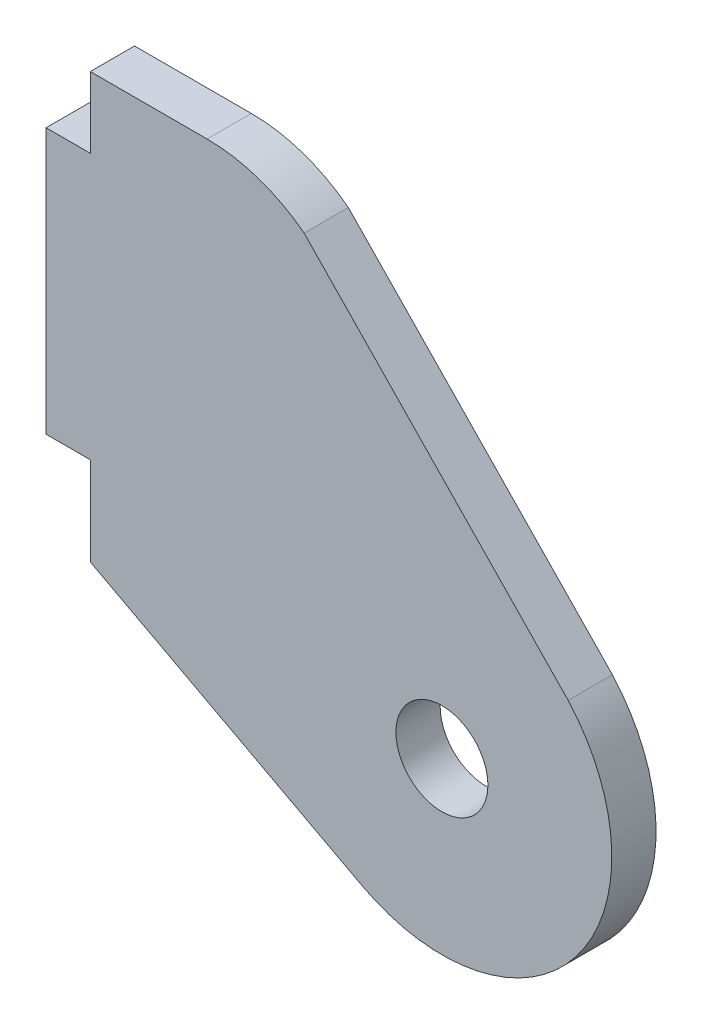
ISO-10303-21;
HEADER;
FILE_DESCRIPTION(('STEP AP214'),'2;1');
FILE_NAME('part.step','',(''),(''),'','','');
FILE_SCHEMA(('AUTOMOTIVE_DESIGN { 1 0 10303 214 1 1 1 1 }'));
ENDSEC;
DATA;
#1=APPLICATION_CONTEXT('core data for automotive mechanical design processes');
#2=APPLICATION_PROTOCOL_DEFINITION('international standard','automotive_design',2000,#1);
#3=PRODUCT_CONTEXT('',#1,'mechanical');
#4=PRODUCT('Part','Part','',(#3));
#5=PRODUCT_RELATED_PRODUCT_CATEGORY('part','',(#4));
#6=PRODUCT_DEFINITION_FORMATION('','',#4);
#7=PRODUCT_DEFINITION_CONTEXT('part definition',#1,'design');
#8=PRODUCT_DEFINITION('design','',#6,#7);
#9=PRODUCT_DEFINITION_SHAPE('','',#8);
#10=(LENGTH_UNIT() NAMED_UNIT(*) SI_UNIT(.MILLI.,.METRE.));
#11=(NAMED_UNIT(*) PLANE_ANGLE_UNIT() SI_UNIT($,.RADIAN.));
#12=(NAMED_UNIT(*) SI_UNIT($,.STERADIAN.) SOLID_ANGLE_UNIT());
#13=UNCERTAINTY_MEASURE_WITH_UNIT(LENGTH_MEASURE(1.E-05),#10,'distance_accuracy_value','');
#14=(GEOMETRIC_REPRESENTATION_CONTEXT(3) GLOBAL_UNCERTAINTY_ASSIGNED_CONTEXT((#13)) GLOBAL_UNIT_ASSIGNED_CONTEXT((#10,
#11,#12)) REPRESENTATION_CONTEXT('',''));
#15=CARTESIAN_POINT('',(0.,0.,0.));
#16=DIRECTION('',(0.,0.,1.));
#17=DIRECTION('',(1.,0.,0.));
#18=AXIS2_PLACEMENT_3D('',#15,#16,#17);
#19=CARTESIAN_POINT('',(-79.4095433377579,-48.870574021423,3.175));
#20=DIRECTION('',(0.,1.,0.));
#21=DIRECTION('',(0.,0.,1.));
#22=AXIS2_PLACEMENT_3D('',#19,#20,#21);
#23=PLANE('',#22);
#24=DIRECTION('',(1.,0.,0.));
#25=VECTOR('',#24,1.);
#26=CARTESIAN_POINT('',(-79.4095433377579,-48.870574021423,0.));
#27=LINE('',#26,#25);
#28=CARTESIAN_POINT('',(-79.4095433377579,-48.870574021423,0.));
#29=VERTEX_POINT('',#28);
#30=CARTESIAN_POINT('',(-76.2345433377579,-48.870574021423,0.));
#31=VERTEX_POINT('',#30);
#32=EDGE_CURVE('E153',#29,#31,#27,.T.);
#33=ORIENTED_EDGE('',*,*,#32,.T.);
#34=DIRECTION('',(0.,0.,-1.));
#35=VECTOR('',#34,1.);
#36=CARTESIAN_POINT('',(-76.2345433377579,-48.870574021423,3.175));
#37=LINE('',#36,#35);
#38=CARTESIAN_POINT('',(-76.2345433377579,-48.870574021423,3.175));
#39=VERTEX_POINT('',#38);
#40=EDGE_CURVE('E11',#39,#31,#37,.T.);
#41=ORIENTED_EDGE('',*,*,#40,.F.);
#42=DIRECTION('',(1.,0.,0.));
#43=VECTOR('',#42,1.);
#44=CARTESIAN_POINT('',(-79.4095433377579,-48.870574021423,3.175));
#45=LINE('',#44,#43);
#46=CARTESIAN_POINT('',(-79.4095433377579,-48.870574021423,3.175));
#47=VERTEX_POINT('',#46);
#48=EDGE_CURVE('E181',#47,#39,#45,.T.);
#49=ORIENTED_EDGE('',*,*,#48,.F.);
#50=DIRECTION('',(0.,0.,-1.));
#51=VECTOR('',#50,1.);
#52=CARTESIAN_POINT('',(-79.4095433377579,-48.870574021423,3.175));
#53=LINE('',#52,#51);
#54=EDGE_CURVE('E149',#47,#29,#53,.T.);
#55=ORIENTED_EDGE('',*,*,#54,.T.);
#56=EDGE_LOOP('',(#33,#41,#49,#55));
#57=FACE_BOUND('',#56,.T.);
#58=ADVANCED_FACE('F39',(#57),#23,.F.);
#59=CARTESIAN_POINT('',(-76.2345433377579,-48.870574021423,3.175));
#60=DIRECTION('',(1.,0.,0.));
#61=DIRECTION('',(0.,1.,0.));
#62=AXIS2_PLACEMENT_3D('',#59,#60,#61);
#63=PLANE('',#62);
#64=DIRECTION('',(0.,-1.,0.));
#65=VECTOR('',#64,1.);
#66=CARTESIAN_POINT('',(-76.2345433377579,-48.870574021423,0.));
#67=LINE('',#66,#65);
#68=CARTESIAN_POINT('',(-76.2345433377579,-55.220574021423,0.));
#69=VERTEX_POINT('',#68);
#70=EDGE_CURVE('E157',#31,#69,#67,.T.);
#71=ORIENTED_EDGE('',*,*,#70,.T.);
#72=DIRECTION('',(0.,0.,-1.));
#73=VECTOR('',#72,1.);
#74=CARTESIAN_POINT('',(-76.2345433377579,-55.220574021423,3.175));
#75=LINE('',#74,#73);
#76=CARTESIAN_POINT('',(-76.2345433377579,-55.220574021423,3.175));
#77=VERTEX_POINT('',#76);
#78=EDGE_CURVE('E49',#77,#69,#75,.T.);
#79=ORIENTED_EDGE('',*,*,#78,.F.);
#80=DIRECTION('',(0.,-1.,0.));
#81=VECTOR('',#80,1.);
#82=CARTESIAN_POINT('',(-76.2345433377579,-48.870574021423,3.175));
#83=LINE('',#82,#81);
#84=EDGE_CURVE('E106',#39,#77,#83,.T.);
#85=ORIENTED_EDGE('',*,*,#84,.F.);
#86=ORIENTED_EDGE('',*,*,#40,.T.);
#87=EDGE_LOOP('',(#71,#79,#85,#86));
#88=FACE_BOUND('',#87,.T.);
#89=ADVANCED_FACE('F267',(#88),#63,.F.);
#90=CARTESIAN_POINT('',(-76.2345433377579,-55.220574021423,3.175));
#91=DIRECTION('',(0.469471562785889,0.882947592858928,0.));
#92=DIRECTION('',(-0.882947592858928,0.469471562785889,0.));
#93=AXIS2_PLACEMENT_3D('',#90,#91,#92);
#94=PLANE('',#93);
#95=DIRECTION('',(0.882947592858928,-0.469471562785889,0.));
#96=VECTOR('',#95,1.);
#97=CARTESIAN_POINT('',(-76.2345433377579,-55.220574021423,0.));
#98=LINE('',#97,#96);
#99=CARTESIAN_POINT('',(-56.7231674307613,-65.5949566158656,0.));
#100=VERTEX_POINT('',#99);
#101=EDGE_CURVE('E160',#69,#100,#98,.T.);
#102=ORIENTED_EDGE('',*,*,#101,.T.);
#103=DIRECTION('',(0.,0.,-1.));
#104=VECTOR('',#103,1.);
#105=CARTESIAN_POINT('',(-56.7231674307613,-65.5949566158656,3.175));
#106=LINE('',#105,#104);
#107=CARTESIAN_POINT('',(-56.7231674307613,-65.5949566158656,3.175));
#108=VERTEX_POINT('',#107);
#109=EDGE_CURVE('E200',#108,#100,#106,.T.);
#110=ORIENTED_EDGE('',*,*,#109,.F.);
#111=DIRECTION('',(0.882947592858928,-0.469471562785889,0.));
#112=VECTOR('',#111,1.);
#113=CARTESIAN_POINT('',(-76.2345433377579,-55.220574021423,3.175));
#114=LINE('',#113,#112);
#115=EDGE_CURVE('E211',#77,#108,#114,.T.);
#116=ORIENTED_EDGE('',*,*,#115,.F.);
#117=ORIENTED_EDGE('',*,*,#78,.T.);
#118=EDGE_LOOP('',(#102,#110,#116,#117));
#119=FACE_BOUND('',#118,.T.);
#120=ADVANCED_FACE('F209',(#119),#94,.F.);
#121=CARTESIAN_POINT('',(-50.9993701372758,-54.8300595637295,3.175));
#122=DIRECTION('',(0.,0.,-1.));
#123=DIRECTION('',(-1.,0.,0.));
#124=AXIS2_PLACEMENT_3D('',#121,#122,#123);
#125=CYLINDRICAL_SURFACE('',#124,12.192);
#126=CARTESIAN_POINT('',(-50.9993701372758,-54.8300595637295,0.));
#127=DIRECTION('',(0.,0.,1.));
#128=DIRECTION('',(1.,0.,0.));
#129=AXIS2_PLACEMENT_3D('',#126,#127,#128);
#130=CIRCLE('',#129,12.192);
#131=CARTESIAN_POINT('',(-41.9389484250555,-46.6720192110023,0.));
#132=VERTEX_POINT('',#131);
#133=EDGE_CURVE('E163',#100,#132,#130,.T.);
#134=ORIENTED_EDGE('',*,*,#133,.T.);
#135=DIRECTION('',(0.,0.,-1.));
#136=VECTOR('',#135,1.);
#137=CARTESIAN_POINT('',(-41.9389484250555,-46.6720192110023,3.175));
#138=LINE('',#137,#136);
#139=CARTESIAN_POINT('',(-41.9389484250555,-46.6720192110023,3.175));
#140=VERTEX_POINT('',#139);
#141=EDGE_CURVE('E196',#140,#132,#138,.T.);
#142=ORIENTED_EDGE('',*,*,#141,.F.);
#143=CARTESIAN_POINT('',(-50.9993701372758,-54.8300595637295,3.175));
#144=DIRECTION('',(0.,0.,1.));
#145=DIRECTION('',(1.,0.,0.));
#146=AXIS2_PLACEMENT_3D('',#143,#144,#145);
#147=CIRCLE('',#146,12.192);
#148=EDGE_CURVE('E230',#108,#140,#147,.T.);
#149=ORIENTED_EDGE('',*,*,#148,.F.);
#150=ORIENTED_EDGE('',*,*,#109,.T.);
#151=EDGE_LOOP('',(#134,#142,#149,#150));
#152=FACE_BOUND('',#151,.T.);
#153=ADVANCED_FACE('F220',(#152),#125,.T.);
#154=CARTESIAN_POINT('',(-60.8896531494987,-27.1061898599786,3.175));
#155=DIRECTION('',(-0.718307964705951,-0.695725281874961,0.));
#156=DIRECTION('',(0.695725281874961,-0.718307964705951,0.));
#157=AXIS2_PLACEMENT_3D('',#154,#155,#156);
#158=PLANE('',#157);
#159=DIRECTION('',(-0.695725281874961,0.718307964705951,0.));
#160=VECTOR('',#159,1.);
#161=CARTESIAN_POINT('',(-60.8896531494987,-27.1061898599786,0.));
#162=LINE('',#161,#160);
#163=CARTESIAN_POINT('',(-60.8896531494987,-27.1061898599786,0.));
#164=VERTEX_POINT('',#163);
#165=EDGE_CURVE('E166',#132,#164,#162,.T.);
#166=ORIENTED_EDGE('',*,*,#165,.T.);
#167=DIRECTION('',(0.,0.,-1.));
#168=VECTOR('',#167,1.);
#169=CARTESIAN_POINT('',(-60.8896531494987,-27.1061898599786,3.175));
#170=LINE('',#169,#168);
#171=CARTESIAN_POINT('',(-60.8896531494987,-27.1061898599786,3.175));
#172=VERTEX_POINT('',#171);
#173=EDGE_CURVE('E192',#172,#164,#170,.T.);
#174=ORIENTED_EDGE('',*,*,#173,.F.);
#175=DIRECTION('',(-0.695725281874961,0.718307964705951,0.));
#176=VECTOR('',#175,1.);
#177=CARTESIAN_POINT('',(-60.8896531494987,-27.1061898599786,3.175));
#178=LINE('',#177,#176);
#179=EDGE_CURVE('E226',#140,#172,#178,.T.);
#180=ORIENTED_EDGE('',*,*,#179,.F.);
#181=ORIENTED_EDGE('',*,*,#141,.T.);
#182=EDGE_LOOP('',(#166,#174,#180,#181));
#183=FACE_BOUND('',#182,.T.);
#184=ADVANCED_FACE('F224',(#183),#158,.F.);
#185=CARTESIAN_POINT('',(-67.8525433377579,-36.170574021423,3.175));
#186=DIRECTION('',(0.,0.,-1.));
#187=DIRECTION('',(-1.,0.,0.));
#188=AXIS2_PLACEMENT_3D('',#185,#186,#187);
#189=CYLINDRICAL_SURFACE('',#188,11.43);
#190=CARTESIAN_POINT('',(-67.8525433377579,-36.170574021423,0.));
#191=DIRECTION('',(0.,0.,1.));
#192=DIRECTION('',(-1.,0.,0.));
#193=AXIS2_PLACEMENT_3D('',#190,#191,#192);
#194=CIRCLE('',#193,11.43);
#195=CARTESIAN_POINT('',(-67.8525433377579,-24.740574021423,0.));
#196=VERTEX_POINT('',#195);
#197=EDGE_CURVE('E169',#164,#196,#194,.T.);
#198=ORIENTED_EDGE('',*,*,#197,.T.);
#199=DIRECTION('',(0.,0.,-1.));
#200=VECTOR('',#199,1.);
#201=CARTESIAN_POINT('',(-67.8525433377579,-24.740574021423,3.175));
#202=LINE('',#201,#200);
#203=CARTESIAN_POINT('',(-67.8525433377579,-24.740574021423,3.175));
#204=VERTEX_POINT('',#203);
#205=EDGE_CURVE('E188',#204,#196,#202,.T.);
#206=ORIENTED_EDGE('',*,*,#205,.F.);
#207=CARTESIAN_POINT('',(-67.8525433377579,-36.170574021423,3.175));
#208=DIRECTION('',(0.,0.,1.));
#209=DIRECTION('',(-1.,0.,0.));
#210=AXIS2_PLACEMENT_3D('',#207,#208,#209);
#211=CIRCLE('',#210,11.43);
#212=EDGE_CURVE('E229',#172,#204,#211,.T.);
#213=ORIENTED_EDGE('',*,*,#212,.F.);
#214=ORIENTED_EDGE('',*,*,#173,.T.);
#215=EDGE_LOOP('',(#198,#206,#213,#214));
#216=FACE_BOUND('',#215,.T.);
#217=ADVANCED_FACE('F279',(#216),#189,.T.);
#218=CARTESIAN_POINT('',(-76.2345433377579,-24.740574021423,3.175));
#219=DIRECTION('',(0.,-1.,0.));
#220=DIRECTION('',(0.,0.,-1.));
#221=AXIS2_PLACEMENT_3D('',#218,#219,#220);
#222=PLANE('',#221);
#223=DIRECTION('',(-1.,0.,0.));
#224=VECTOR('',#223,1.);
#225=CARTESIAN_POINT('',(-76.2345433377579,-24.740574021423,0.));
#226=LINE('',#225,#224);
#227=CARTESIAN_POINT('',(-76.2345433377579,-24.740574021423,0.));
#228=VERTEX_POINT('',#227);
#229=EDGE_CURVE('E172',#196,#228,#226,.T.);
#230=ORIENTED_EDGE('',*,*,#229,.T.);
#231=DIRECTION('',(0.,0.,-1.));
#232=VECTOR('',#231,1.);
#233=CARTESIAN_POINT('',(-76.2345433377579,-24.740574021423,3.175));
#234=LINE('',#233,#232);
#235=CARTESIAN_POINT('',(-76.2345433377579,-24.740574021423,3.175));
#236=VERTEX_POINT('',#235);
#237=EDGE_CURVE('E142',#236,#228,#234,.T.);
#238=ORIENTED_EDGE('',*,*,#237,.F.);
#239=DIRECTION('',(-1.,0.,0.));
#240=VECTOR('',#239,1.);
#241=CARTESIAN_POINT('',(-76.2345433377579,-24.740574021423,3.175));
#242=LINE('',#241,#240);
#243=EDGE_CURVE('E131',#204,#236,#242,.T.);
#244=ORIENTED_EDGE('',*,*,#243,.F.);
#245=ORIENTED_EDGE('',*,*,#205,.T.);
#246=EDGE_LOOP('',(#230,#238,#244,#245));
#247=FACE_BOUND('',#246,.T.);
#248=ADVANCED_FACE('F276',(#247),#222,.F.);
#249=CARTESIAN_POINT('',(-76.2345433377579,-29.820574021423,3.175));
#250=DIRECTION('',(1.,0.,0.));
#251=DIRECTION('',(0.,0.,-1.));
#252=AXIS2_PLACEMENT_3D('',#249,#250,#251);
#253=PLANE('',#252);
#254=DIRECTION('',(0.,-1.,0.));
#255=VECTOR('',#254,1.);
#256=CARTESIAN_POINT('',(-76.2345433377579,-29.820574021423,0.));
#257=LINE('',#256,#255);
#258=CARTESIAN_POINT('',(-76.2345433377579,-29.820574021423,0.));
#259=VERTEX_POINT('',#258);
#260=EDGE_CURVE('E140',#228,#259,#257,.T.);
#261=ORIENTED_EDGE('',*,*,#260,.T.);
#262=DIRECTION('',(0.,0.,-1.));
#263=VECTOR('',#262,1.);
#264=CARTESIAN_POINT('',(-76.2345433377579,-29.820574021423,3.175));
#265=LINE('',#264,#263);
#266=CARTESIAN_POINT('',(-76.2345433377579,-29.820574021423,3.175));
#267=VERTEX_POINT('',#266);
#268=EDGE_CURVE('E137',#267,#259,#265,.T.);
#269=ORIENTED_EDGE('',*,*,#268,.F.);
#270=DIRECTION('',(0.,-1.,0.));
#271=VECTOR('',#270,1.);
#272=CARTESIAN_POINT('',(-76.2345433377579,-29.820574021423,3.175));
#273=LINE('',#272,#271);
#274=EDGE_CURVE('E125',#236,#267,#273,.T.);
#275=ORIENTED_EDGE('',*,*,#274,.F.);
#276=ORIENTED_EDGE('',*,*,#237,.T.);
#277=EDGE_LOOP('',(#261,#269,#275,#276));
#278=FACE_BOUND('',#277,.T.);
#279=ADVANCED_FACE('F138',(#278),#253,.F.);
#280=CARTESIAN_POINT('',(-79.4095433377579,-29.820574021423,3.175));
#281=DIRECTION('',(0.,-1.,0.));
#282=DIRECTION('',(0.,0.,-1.));
#283=AXIS2_PLACEMENT_3D('',#280,#281,#282);
#284=PLANE('',#283);
#285=DIRECTION('',(-1.,0.,0.));
#286=VECTOR('',#285,1.);
#287=CARTESIAN_POINT('',(-79.4095433377579,-29.820574021423,0.));
#288=LINE('',#287,#286);
#289=CARTESIAN_POINT('',(-79.4095433377579,-29.820574021423,0.));
#290=VERTEX_POINT('',#289);
#291=EDGE_CURVE('E92',#259,#290,#288,.T.);
#292=ORIENTED_EDGE('',*,*,#291,.T.);
#293=DIRECTION('',(0.,0.,-1.));
#294=VECTOR('',#293,1.);
#295=CARTESIAN_POINT('',(-79.4095433377579,-29.820574021423,3.175));
#296=LINE('',#295,#294);
#297=CARTESIAN_POINT('',(-79.4095433377579,-29.820574021423,3.175));
#298=VERTEX_POINT('',#297);
#299=EDGE_CURVE('E143',#298,#290,#296,.T.);
#300=ORIENTED_EDGE('',*,*,#299,.F.);
#301=DIRECTION('',(-1.,0.,0.));
#302=VECTOR('',#301,1.);
#303=CARTESIAN_POINT('',(-79.4095433377579,-29.820574021423,3.175));
#304=LINE('',#303,#302);
#305=EDGE_CURVE('E129',#267,#298,#304,.T.);
#306=ORIENTED_EDGE('',*,*,#305,.F.);
#307=ORIENTED_EDGE('',*,*,#268,.T.);
#308=EDGE_LOOP('',(#292,#300,#306,#307));
#309=FACE_BOUND('',#308,.T.);
#310=ADVANCED_FACE('F145',(#309),#284,.F.);
#311=CARTESIAN_POINT('',(-79.4095433377579,-48.870574021423,3.175));
#312=DIRECTION('',(1.,0.,0.));
#313=DIRECTION('',(0.,0.,-1.));
#314=AXIS2_PLACEMENT_3D('',#311,#312,#313);
#315=PLANE('',#314);
#316=DIRECTION('',(0.,-1.,0.));
#317=VECTOR('',#316,1.);
#318=CARTESIAN_POINT('',(-79.4095433377579,-48.870574021423,0.));
#319=LINE('',#318,#317);
#320=EDGE_CURVE('E98',#290,#29,#319,.T.);
#321=ORIENTED_EDGE('',*,*,#320,.T.);
#322=ORIENTED_EDGE('',*,*,#54,.F.);
#323=DIRECTION('',(0.,-1.,0.));
#324=VECTOR('',#323,1.);
#325=CARTESIAN_POINT('',(-79.4095433377579,-48.870574021423,3.175));
#326=LINE('',#325,#324);
#327=EDGE_CURVE('E57',#298,#47,#326,.T.);
#328=ORIENTED_EDGE('',*,*,#327,.F.);
#329=ORIENTED_EDGE('',*,*,#299,.T.);
#330=EDGE_LOOP('',(#321,#322,#328,#329));
#331=FACE_BOUND('',#330,.T.);
#332=ADVANCED_FACE('F256',(#331),#315,.F.);
#333=CARTESIAN_POINT('',(-50.9993701372758,-54.8300595637295,3.175));
#334=DIRECTION('',(0.,0.,1.));
#335=DIRECTION('',(1.,0.,0.));
#336=AXIS2_PLACEMENT_3D('',#333,#334,#335);
#337=PLANE('',#336);
#338=CARTESIAN_POINT('',(-50.9993701372758,-54.8300595637295,3.175));
#339=DIRECTION('',(0.,0.,1.));
#340=DIRECTION('',(1.,0.,0.));
#341=AXIS2_PLACEMENT_3D('',#338,#339,#340);
#342=CIRCLE('',#341,3.3);
#343=CARTESIAN_POINT('',(-47.6993701372758,-54.8300595637295,3.175));
#344=VERTEX_POINT('',#343);
#345=EDGE_CURVE('E42',#344,#344,#342,.T.);
#346=ORIENTED_EDGE('',*,*,#345,.F.);
#347=EDGE_LOOP('',(#346));
#348=FACE_BOUND('',#347,.T.);
#349=ORIENTED_EDGE('',*,*,#48,.T.);
#350=ORIENTED_EDGE('',*,*,#84,.T.);
#351=ORIENTED_EDGE('',*,*,#115,.T.);
#352=ORIENTED_EDGE('',*,*,#148,.T.);
#353=ORIENTED_EDGE('',*,*,#179,.T.);
#354=ORIENTED_EDGE('',*,*,#212,.T.);
#355=ORIENTED_EDGE('',*,*,#243,.T.);
#356=ORIENTED_EDGE('',*,*,#274,.T.);
#357=ORIENTED_EDGE('',*,*,#305,.T.);
#358=ORIENTED_EDGE('',*,*,#327,.T.);
#359=EDGE_LOOP('',(#349,#350,#351,#352,#353,#354,#355,#356,#357,#358));
#360=FACE_BOUND('',#359,.T.);
#361=ADVANCED_FACE('F127',(#348,#360),#337,.T.);
#362=CARTESIAN_POINT('',(-50.9993701372758,-54.8300595637295,0.));
#363=DIRECTION('',(0.,0.,1.));
#364=DIRECTION('',(1.,0.,0.));
#365=AXIS2_PLACEMENT_3D('',#362,#363,#364);
#366=PLANE('',#365);
#367=CARTESIAN_POINT('',(-50.9993701372758,-54.8300595637295,0.));
#368=DIRECTION('',(0.,0.,-1.));
#369=DIRECTION('',(-1.,0.,0.));
#370=AXIS2_PLACEMENT_3D('',#367,#368,#369);
#371=CIRCLE('',#370,3.3);
#372=CARTESIAN_POINT('',(-54.2993701372758,-54.8300595637295,0.));
#373=VERTEX_POINT('',#372);
#374=EDGE_CURVE('E244',#373,#373,#371,.T.);
#375=ORIENTED_EDGE('',*,*,#374,.F.);
#376=EDGE_LOOP('',(#375));
#377=FACE_BOUND('',#376,.T.);
#378=ORIENTED_EDGE('',*,*,#32,.F.);
#379=ORIENTED_EDGE('',*,*,#320,.F.);
#380=ORIENTED_EDGE('',*,*,#291,.F.);
#381=ORIENTED_EDGE('',*,*,#260,.F.);
#382=ORIENTED_EDGE('',*,*,#229,.F.);
#383=ORIENTED_EDGE('',*,*,#197,.F.);
#384=ORIENTED_EDGE('',*,*,#165,.F.);
#385=ORIENTED_EDGE('',*,*,#133,.F.);
#386=ORIENTED_EDGE('',*,*,#101,.F.);
#387=ORIENTED_EDGE('',*,*,#70,.F.);
#388=EDGE_LOOP('',(#378,#379,#380,#381,#382,#383,#384,#385,#386,#387));
#389=FACE_BOUND('',#388,.T.);
#390=ADVANCED_FACE('F215',(#377,#389),#366,.F.);
#391=CARTESIAN_POINT('',(-50.9993701372758,-54.8300595637295,0.));
#392=DIRECTION('',(0.,0.,-1.));
#393=DIRECTION('',(-1.,0.,0.));
#394=AXIS2_PLACEMENT_3D('',#391,#392,#393);
#395=CYLINDRICAL_SURFACE('',#394,3.3);
#396=ORIENTED_EDGE('',*,*,#345,.T.);
#397=EDGE_LOOP('',(#396));
#398=FACE_BOUND('',#397,.T.);
#399=ORIENTED_EDGE('',*,*,#374,.T.);
#400=EDGE_LOOP('',(#399));
#401=FACE_BOUND('',#400,.T.);
#402=ADVANCED_FACE('F253',(#398,#401),#395,.F.);
#403=CLOSED_SHELL('',(#58,#89,#120,#153,#184,#217,#248,#279,#310,#332,#361,#390,#402));
#404=MANIFOLD_SOLID_BREP('B2',#403);
#405=ADVANCED_BREP_SHAPE_REPRESENTATION('',(#18,#404),#14);
#406=SHAPE_DEFINITION_REPRESENTATION(#9,#405);
ENDSEC;
END-ISO-10303-21;
